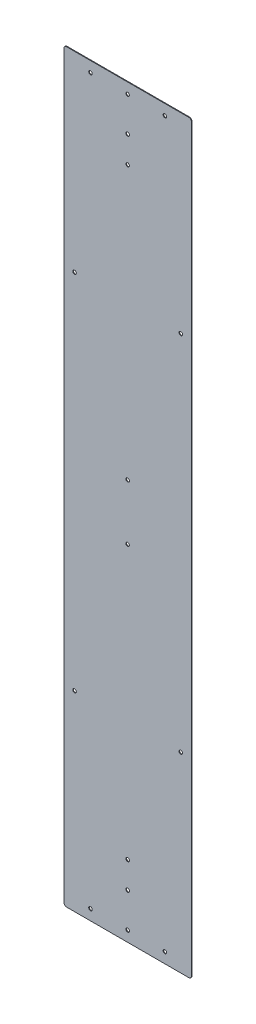
ISO-10303-21;
HEADER;
FILE_DESCRIPTION(('STEP AP214'),'2;1');
FILE_NAME('part.step','',(''),(''),'','','');
FILE_SCHEMA(('AUTOMOTIVE_DESIGN { 1 0 10303 214 1 1 1 1 }'));
ENDSEC;
DATA;
#1=APPLICATION_CONTEXT('core data for automotive mechanical design processes');
#2=APPLICATION_PROTOCOL_DEFINITION('international standard','automotive_design',2000,#1);
#3=PRODUCT_CONTEXT('',#1,'mechanical');
#4=PRODUCT('Part','Part','',(#3));
#5=PRODUCT_RELATED_PRODUCT_CATEGORY('part','',(#4));
#6=PRODUCT_DEFINITION_FORMATION('','',#4);
#7=PRODUCT_DEFINITION_CONTEXT('part definition',#1,'design');
#8=PRODUCT_DEFINITION('design','',#6,#7);
#9=PRODUCT_DEFINITION_SHAPE('','',#8);
#10=(LENGTH_UNIT() NAMED_UNIT(*) SI_UNIT(.MILLI.,.METRE.));
#11=(NAMED_UNIT(*) PLANE_ANGLE_UNIT() SI_UNIT($,.RADIAN.));
#12=(NAMED_UNIT(*) SI_UNIT($,.STERADIAN.) SOLID_ANGLE_UNIT());
#13=UNCERTAINTY_MEASURE_WITH_UNIT(LENGTH_MEASURE(1.E-05),#10,'distance_accuracy_value','');
#14=(GEOMETRIC_REPRESENTATION_CONTEXT(3) GLOBAL_UNCERTAINTY_ASSIGNED_CONTEXT((#13)) GLOBAL_UNIT_ASSIGNED_CONTEXT((#10,
#11,#12)) REPRESENTATION_CONTEXT('',''));
#15=CARTESIAN_POINT('',(0.,0.,0.));
#16=DIRECTION('',(0.,0.,1.));
#17=DIRECTION('',(1.,0.,0.));
#18=AXIS2_PLACEMENT_3D('',#15,#16,#17);
#19=CARTESIAN_POINT('',(152.4,890.5875,1.5875));
#20=DIRECTION('',(-1.,0.,0.));
#21=DIRECTION('',(0.,-1.,0.));
#22=AXIS2_PLACEMENT_3D('',#19,#20,#21);
#23=PLANE('',#22);
#24=DIRECTION('',(0.,1.,0.));
#25=VECTOR('',#24,1.);
#26=CARTESIAN_POINT('',(152.4,890.5875,0.));
#27=LINE('',#26,#25);
#28=CARTESIAN_POINT('',(152.4,-884.2375,0.));
#29=VERTEX_POINT('',#28);
#30=CARTESIAN_POINT('',(152.4,884.2375,0.));
#31=VERTEX_POINT('',#30);
#32=EDGE_CURVE('E128',#29,#31,#27,.T.);
#33=ORIENTED_EDGE('',*,*,#32,.T.);
#34=DIRECTION('',(0.,0.,-1.));
#35=VECTOR('',#34,1.);
#36=CARTESIAN_POINT('',(152.4,884.2375,1.5875));
#37=LINE('',#36,#35);
#38=CARTESIAN_POINT('',(152.4,884.2375,1.5875));
#39=VERTEX_POINT('',#38);
#40=EDGE_CURVE('E151',#31,#39,#37,.F.);
#41=ORIENTED_EDGE('',*,*,#40,.T.);
#42=DIRECTION('',(0.,1.,0.));
#43=VECTOR('',#42,1.);
#44=CARTESIAN_POINT('',(152.4,890.5875,1.5875));
#45=LINE('',#44,#43);
#46=CARTESIAN_POINT('',(152.4,-884.2375,1.5875));
#47=VERTEX_POINT('',#46);
#48=EDGE_CURVE('E126',#47,#39,#45,.T.);
#49=ORIENTED_EDGE('',*,*,#48,.F.);
#50=DIRECTION('',(0.,0.,-1.));
#51=VECTOR('',#50,1.);
#52=CARTESIAN_POINT('',(152.4,-884.2375,1.5875));
#53=LINE('',#52,#51);
#54=EDGE_CURVE('E148',#47,#29,#53,.T.);
#55=ORIENTED_EDGE('',*,*,#54,.T.);
#56=EDGE_LOOP('',(#33,#41,#49,#55));
#57=FACE_BOUND('',#56,.T.);
#58=ADVANCED_FACE('F33',(#57),#23,.F.);
#59=CARTESIAN_POINT('',(-152.4,890.5875,1.5875));
#60=DIRECTION('',(0.,-1.,0.));
#61=DIRECTION('',(0.,0.,-1.));
#62=AXIS2_PLACEMENT_3D('',#59,#60,#61);
#63=PLANE('',#62);
#64=DIRECTION('',(-1.,0.,0.));
#65=VECTOR('',#64,1.);
#66=CARTESIAN_POINT('',(-152.4,890.5875,0.));
#67=LINE('',#66,#65);
#68=CARTESIAN_POINT('',(146.05,890.5875,0.));
#69=VERTEX_POINT('',#68);
#70=CARTESIAN_POINT('',(-146.05,890.5875,0.));
#71=VERTEX_POINT('',#70);
#72=EDGE_CURVE('E124',#69,#71,#67,.T.);
#73=ORIENTED_EDGE('',*,*,#72,.T.);
#74=DIRECTION('',(0.,0.,-1.));
#75=VECTOR('',#74,1.);
#76=CARTESIAN_POINT('',(-146.05,890.5875,1.5875));
#77=LINE('',#76,#75);
#78=CARTESIAN_POINT('',(-146.05,890.5875,1.5875));
#79=VERTEX_POINT('',#78);
#80=EDGE_CURVE('E103',#71,#79,#77,.F.);
#81=ORIENTED_EDGE('',*,*,#80,.T.);
#82=DIRECTION('',(-1.,0.,0.));
#83=VECTOR('',#82,1.);
#84=CARTESIAN_POINT('',(-152.4,890.5875,1.5875));
#85=LINE('',#84,#83);
#86=CARTESIAN_POINT('',(146.05,890.5875,1.5875));
#87=VERTEX_POINT('',#86);
#88=EDGE_CURVE('E167',#87,#79,#85,.T.);
#89=ORIENTED_EDGE('',*,*,#88,.F.);
#90=DIRECTION('',(0.,0.,-1.));
#91=VECTOR('',#90,1.);
#92=CARTESIAN_POINT('',(146.05,890.5875,1.5875));
#93=LINE('',#92,#91);
#94=EDGE_CURVE('E108',#87,#69,#93,.T.);
#95=ORIENTED_EDGE('',*,*,#94,.T.);
#96=EDGE_LOOP('',(#73,#81,#89,#95));
#97=FACE_BOUND('',#96,.T.);
#98=ADVANCED_FACE('F312',(#97),#63,.F.);
#99=CARTESIAN_POINT('',(-152.4,890.5875,1.5875));
#100=DIRECTION('',(1.,0.,0.));
#101=DIRECTION('',(0.,1.,0.));
#102=AXIS2_PLACEMENT_3D('',#99,#100,#101);
#103=PLANE('',#102);
#104=DIRECTION('',(0.,-1.,0.));
#105=VECTOR('',#104,1.);
#106=CARTESIAN_POINT('',(-152.4,890.5875,1.5875));
#107=LINE('',#106,#105);
#108=CARTESIAN_POINT('',(-152.4,884.2375,1.5875));
#109=VERTEX_POINT('',#108);
#110=CARTESIAN_POINT('',(-152.4,-884.2375,1.5875));
#111=VERTEX_POINT('',#110);
#112=EDGE_CURVE('E117',#109,#111,#107,.T.);
#113=ORIENTED_EDGE('',*,*,#112,.F.);
#114=DIRECTION('',(0.,0.,-1.));
#115=VECTOR('',#114,1.);
#116=CARTESIAN_POINT('',(-152.4,884.2375,1.5875));
#117=LINE('',#116,#115);
#118=CARTESIAN_POINT('',(-152.4,884.2375,0.));
#119=VERTEX_POINT('',#118);
#120=EDGE_CURVE('E102',#109,#119,#117,.T.);
#121=ORIENTED_EDGE('',*,*,#120,.T.);
#122=DIRECTION('',(0.,-1.,0.));
#123=VECTOR('',#122,1.);
#124=CARTESIAN_POINT('',(-152.4,890.5875,0.));
#125=LINE('',#124,#123);
#126=CARTESIAN_POINT('',(-152.4,-884.2375,0.));
#127=VERTEX_POINT('',#126);
#128=EDGE_CURVE('E115',#119,#127,#125,.T.);
#129=ORIENTED_EDGE('',*,*,#128,.T.);
#130=DIRECTION('',(0.,0.,-1.));
#131=VECTOR('',#130,1.);
#132=CARTESIAN_POINT('',(-152.4,-884.2375,1.5875));
#133=LINE('',#132,#131);
#134=EDGE_CURVE('E119',#127,#111,#133,.F.);
#135=ORIENTED_EDGE('',*,*,#134,.T.);
#136=EDGE_LOOP('',(#113,#121,#129,#135));
#137=FACE_BOUND('',#136,.T.);
#138=ADVANCED_FACE('F114',(#137),#103,.F.);
#139=CARTESIAN_POINT('',(-152.4,-890.5875,1.5875));
#140=DIRECTION('',(0.,1.,0.));
#141=DIRECTION('',(0.,0.,1.));
#142=AXIS2_PLACEMENT_3D('',#139,#140,#141);
#143=PLANE('',#142);
#144=DIRECTION('',(1.,0.,0.));
#145=VECTOR('',#144,1.);
#146=CARTESIAN_POINT('',(-152.4,-890.5875,0.));
#147=LINE('',#146,#145);
#148=CARTESIAN_POINT('',(-146.05,-890.5875,0.));
#149=VERTEX_POINT('',#148);
#150=CARTESIAN_POINT('',(146.05,-890.5875,0.));
#151=VERTEX_POINT('',#150);
#152=EDGE_CURVE('E123',#149,#151,#147,.T.);
#153=ORIENTED_EDGE('',*,*,#152,.T.);
#154=DIRECTION('',(0.,0.,-1.));
#155=VECTOR('',#154,1.);
#156=CARTESIAN_POINT('',(146.05,-890.5875,1.5875));
#157=LINE('',#156,#155);
#158=CARTESIAN_POINT('',(146.05,-890.5875,1.5875));
#159=VERTEX_POINT('',#158);
#160=EDGE_CURVE('E11',#151,#159,#157,.F.);
#161=ORIENTED_EDGE('',*,*,#160,.T.);
#162=DIRECTION('',(1.,0.,0.));
#163=VECTOR('',#162,1.);
#164=CARTESIAN_POINT('',(-152.4,-890.5875,1.5875));
#165=LINE('',#164,#163);
#166=CARTESIAN_POINT('',(-146.05,-890.5875,1.5875));
#167=VERTEX_POINT('',#166);
#168=EDGE_CURVE('E132',#167,#159,#165,.T.);
#169=ORIENTED_EDGE('',*,*,#168,.F.);
#170=DIRECTION('',(0.,0.,-1.));
#171=VECTOR('',#170,1.);
#172=CARTESIAN_POINT('',(-146.05,-890.5875,1.5875));
#173=LINE('',#172,#171);
#174=EDGE_CURVE('E41',#167,#149,#173,.T.);
#175=ORIENTED_EDGE('',*,*,#174,.T.);
#176=EDGE_LOOP('',(#153,#161,#169,#175));
#177=FACE_BOUND('',#176,.T.);
#178=ADVANCED_FACE('F154',(#177),#143,.F.);
#179=CARTESIAN_POINT('',(0.,0.,1.5875));
#180=DIRECTION('',(0.,0.,1.));
#181=DIRECTION('',(1.,0.,0.));
#182=AXIS2_PLACEMENT_3D('',#179,#180,#181);
#183=PLANE('',#182);
#184=CARTESIAN_POINT('',(0.,865.1875,1.5875));
#185=DIRECTION('',(0.,0.,1.));
#186=DIRECTION('',(1.,0.,0.));
#187=AXIS2_PLACEMENT_3D('',#184,#185,#186);
#188=CIRCLE('',#187,4.2164);
#189=CARTESIAN_POINT('',(4.2164,865.1875,1.5875));
#190=VERTEX_POINT('',#189);
#191=EDGE_CURVE('E271',#190,#190,#188,.T.);
#192=ORIENTED_EDGE('',*,*,#191,.F.);
#193=EDGE_LOOP('',(#192));
#194=FACE_BOUND('',#193,.T.);
#195=CARTESIAN_POINT('',(-127.,433.3875,1.5875));
#196=DIRECTION('',(0.,0.,1.));
#197=DIRECTION('',(1.,0.,0.));
#198=AXIS2_PLACEMENT_3D('',#195,#196,#197);
#199=CIRCLE('',#198,4.21639999999999);
#200=CARTESIAN_POINT('',(-122.7836,433.3875,1.5875));
#201=VERTEX_POINT('',#200);
#202=EDGE_CURVE('E265',#201,#201,#199,.T.);
#203=ORIENTED_EDGE('',*,*,#202,.F.);
#204=EDGE_LOOP('',(#203));
#205=FACE_BOUND('',#204,.T.);
#206=CARTESIAN_POINT('',(127.,433.3875,1.5875));
#207=DIRECTION('',(0.,0.,1.));
#208=DIRECTION('',(1.,0.,0.));
#209=AXIS2_PLACEMENT_3D('',#206,#207,#208);
#210=CIRCLE('',#209,4.21640000000001);
#211=CARTESIAN_POINT('',(131.2164,433.3875,1.5875));
#212=VERTEX_POINT('',#211);
#213=EDGE_CURVE('E259',#212,#212,#210,.T.);
#214=ORIENTED_EDGE('',*,*,#213,.F.);
#215=EDGE_LOOP('',(#214));
#216=FACE_BOUND('',#215,.T.);
#217=CARTESIAN_POINT('',(0.,66.675,1.5875));
#218=DIRECTION('',(0.,0.,1.));
#219=DIRECTION('',(1.,0.,0.));
#220=AXIS2_PLACEMENT_3D('',#217,#218,#219);
#221=CIRCLE('',#220,4.2164);
#222=CARTESIAN_POINT('',(4.2164,66.675,1.5875));
#223=VERTEX_POINT('',#222);
#224=EDGE_CURVE('E253',#223,#223,#221,.T.);
#225=ORIENTED_EDGE('',*,*,#224,.F.);
#226=EDGE_LOOP('',(#225));
#227=FACE_BOUND('',#226,.T.);
#228=CARTESIAN_POINT('',(0.,-66.6749999999998,1.5875));
#229=DIRECTION('',(0.,0.,1.));
#230=DIRECTION('',(1.,0.,0.));
#231=AXIS2_PLACEMENT_3D('',#228,#229,#230);
#232=CIRCLE('',#231,4.2164);
#233=CARTESIAN_POINT('',(4.2164,-66.6749999999998,1.5875));
#234=VERTEX_POINT('',#233);
#235=EDGE_CURVE('E247',#234,#234,#232,.T.);
#236=ORIENTED_EDGE('',*,*,#235,.F.);
#237=EDGE_LOOP('',(#236));
#238=FACE_BOUND('',#237,.T.);
#239=CARTESIAN_POINT('',(-127.,-433.3875,1.5875));
#240=DIRECTION('',(0.,0.,1.));
#241=DIRECTION('',(1.,0.,0.));
#242=AXIS2_PLACEMENT_3D('',#239,#240,#241);
#243=CIRCLE('',#242,4.21639999999999);
#244=CARTESIAN_POINT('',(-122.7836,-433.3875,1.5875));
#245=VERTEX_POINT('',#244);
#246=EDGE_CURVE('E241',#245,#245,#243,.T.);
#247=ORIENTED_EDGE('',*,*,#246,.F.);
#248=EDGE_LOOP('',(#247));
#249=FACE_BOUND('',#248,.T.);
#250=CARTESIAN_POINT('',(127.,-433.3875,1.5875));
#251=DIRECTION('',(0.,0.,1.));
#252=DIRECTION('',(1.,0.,0.));
#253=AXIS2_PLACEMENT_3D('',#250,#251,#252);
#254=CIRCLE('',#253,4.21640000000001);
#255=CARTESIAN_POINT('',(131.2164,-433.3875,1.5875));
#256=VERTEX_POINT('',#255);
#257=EDGE_CURVE('E235',#256,#256,#254,.T.);
#258=ORIENTED_EDGE('',*,*,#257,.F.);
#259=EDGE_LOOP('',(#258));
#260=FACE_BOUND('',#259,.T.);
#261=CARTESIAN_POINT('',(0.,-865.1875,1.5875));
#262=DIRECTION('',(0.,0.,1.));
#263=DIRECTION('',(1.,0.,0.));
#264=AXIS2_PLACEMENT_3D('',#261,#262,#263);
#265=CIRCLE('',#264,4.2164);
#266=CARTESIAN_POINT('',(4.2164,-865.1875,1.5875));
#267=VERTEX_POINT('',#266);
#268=EDGE_CURVE('E229',#267,#267,#265,.T.);
#269=ORIENTED_EDGE('',*,*,#268,.F.);
#270=EDGE_LOOP('',(#269));
#271=FACE_BOUND('',#270,.T.);
#272=CARTESIAN_POINT('',(0.,782.6375,1.5875));
#273=DIRECTION('',(0.,0.,1.));
#274=DIRECTION('',(1.,0.,0.));
#275=AXIS2_PLACEMENT_3D('',#272,#273,#274);
#276=CIRCLE('',#275,4.2164);
#277=CARTESIAN_POINT('',(4.2164,782.6375,1.5875));
#278=VERTEX_POINT('',#277);
#279=EDGE_CURVE('E223',#278,#278,#276,.T.);
#280=ORIENTED_EDGE('',*,*,#279,.F.);
#281=EDGE_LOOP('',(#280));
#282=FACE_BOUND('',#281,.T.);
#283=CARTESIAN_POINT('',(0.,719.1375,1.5875));
#284=DIRECTION('',(0.,0.,1.));
#285=DIRECTION('',(1.,0.,0.));
#286=AXIS2_PLACEMENT_3D('',#283,#284,#285);
#287=CIRCLE('',#286,4.2164);
#288=CARTESIAN_POINT('',(4.2164,719.1375,1.5875));
#289=VERTEX_POINT('',#288);
#290=EDGE_CURVE('E217',#289,#289,#287,.T.);
#291=ORIENTED_EDGE('',*,*,#290,.F.);
#292=EDGE_LOOP('',(#291));
#293=FACE_BOUND('',#292,.T.);
#294=CARTESIAN_POINT('',(0.,-782.6375,1.5875));
#295=DIRECTION('',(0.,0.,1.));
#296=DIRECTION('',(1.,0.,0.));
#297=AXIS2_PLACEMENT_3D('',#294,#295,#296);
#298=CIRCLE('',#297,4.2164);
#299=CARTESIAN_POINT('',(4.2164,-782.6375,1.5875));
#300=VERTEX_POINT('',#299);
#301=EDGE_CURVE('E211',#300,#300,#298,.T.);
#302=ORIENTED_EDGE('',*,*,#301,.F.);
#303=EDGE_LOOP('',(#302));
#304=FACE_BOUND('',#303,.T.);
#305=CARTESIAN_POINT('',(0.,-719.1375,1.5875));
#306=DIRECTION('',(0.,0.,1.));
#307=DIRECTION('',(1.,0.,0.));
#308=AXIS2_PLACEMENT_3D('',#305,#306,#307);
#309=CIRCLE('',#308,4.2164);
#310=CARTESIAN_POINT('',(4.2164,-719.1375,1.5875));
#311=VERTEX_POINT('',#310);
#312=EDGE_CURVE('E205',#311,#311,#309,.T.);
#313=ORIENTED_EDGE('',*,*,#312,.F.);
#314=EDGE_LOOP('',(#313));
#315=FACE_BOUND('',#314,.T.);
#316=CARTESIAN_POINT('',(-88.9,865.1875,1.5875));
#317=DIRECTION('',(0.,0.,1.));
#318=DIRECTION('',(1.,0.,0.));
#319=AXIS2_PLACEMENT_3D('',#316,#317,#318);
#320=CIRCLE('',#319,4.21639999999999);
#321=CARTESIAN_POINT('',(-84.6836,865.1875,1.5875));
#322=VERTEX_POINT('',#321);
#323=EDGE_CURVE('E199',#322,#322,#320,.T.);
#324=ORIENTED_EDGE('',*,*,#323,.F.);
#325=EDGE_LOOP('',(#324));
#326=FACE_BOUND('',#325,.T.);
#327=CARTESIAN_POINT('',(88.9,865.1875,1.5875));
#328=DIRECTION('',(0.,0.,1.));
#329=DIRECTION('',(1.,0.,0.));
#330=AXIS2_PLACEMENT_3D('',#327,#328,#329);
#331=CIRCLE('',#330,4.21639999999999);
#332=CARTESIAN_POINT('',(93.1164,865.1875,1.5875));
#333=VERTEX_POINT('',#332);
#334=EDGE_CURVE('E193',#333,#333,#331,.T.);
#335=ORIENTED_EDGE('',*,*,#334,.F.);
#336=EDGE_LOOP('',(#335));
#337=FACE_BOUND('',#336,.T.);
#338=CARTESIAN_POINT('',(-88.8999999999989,-865.1875,1.5875));
#339=DIRECTION('',(0.,0.,1.));
#340=DIRECTION('',(1.,0.,0.));
#341=AXIS2_PLACEMENT_3D('',#338,#339,#340);
#342=CIRCLE('',#341,4.21639999999999);
#343=CARTESIAN_POINT('',(-84.6835999999989,-865.1875,1.5875));
#344=VERTEX_POINT('',#343);
#345=EDGE_CURVE('E185',#344,#344,#342,.T.);
#346=ORIENTED_EDGE('',*,*,#345,.F.);
#347=EDGE_LOOP('',(#346));
#348=FACE_BOUND('',#347,.T.);
#349=CARTESIAN_POINT('',(88.9,-865.1875,1.5875));
#350=DIRECTION('',(0.,0.,1.));
#351=DIRECTION('',(1.,0.,0.));
#352=AXIS2_PLACEMENT_3D('',#349,#350,#351);
#353=CIRCLE('',#352,4.21639999999999);
#354=CARTESIAN_POINT('',(93.1164,-865.1875,1.5875));
#355=VERTEX_POINT('',#354);
#356=EDGE_CURVE('E177',#355,#355,#353,.T.);
#357=ORIENTED_EDGE('',*,*,#356,.F.);
#358=EDGE_LOOP('',(#357));
#359=FACE_BOUND('',#358,.T.);
#360=ORIENTED_EDGE('',*,*,#88,.T.);
#361=CARTESIAN_POINT('',(-146.05,884.2375,1.5875));
#362=DIRECTION('',(0.,0.,1.));
#363=DIRECTION('',(1.,0.,0.));
#364=AXIS2_PLACEMENT_3D('',#361,#362,#363);
#365=CIRCLE('',#364,6.35);
#366=EDGE_CURVE('E146',#79,#109,#365,.T.);
#367=ORIENTED_EDGE('',*,*,#366,.T.);
#368=ORIENTED_EDGE('',*,*,#112,.T.);
#369=CARTESIAN_POINT('',(-146.05,-884.2375,1.5875));
#370=DIRECTION('',(0.,0.,1.));
#371=DIRECTION('',(1.,0.,0.));
#372=AXIS2_PLACEMENT_3D('',#369,#370,#371);
#373=CIRCLE('',#372,6.35);
#374=EDGE_CURVE('E53',#111,#167,#373,.T.);
#375=ORIENTED_EDGE('',*,*,#374,.T.);
#376=ORIENTED_EDGE('',*,*,#168,.T.);
#377=CARTESIAN_POINT('',(146.05,-884.2375,1.5875));
#378=DIRECTION('',(0.,0.,1.));
#379=DIRECTION('',(1.,0.,0.));
#380=AXIS2_PLACEMENT_3D('',#377,#378,#379);
#381=CIRCLE('',#380,6.35);
#382=EDGE_CURVE('E142',#159,#47,#381,.T.);
#383=ORIENTED_EDGE('',*,*,#382,.T.);
#384=ORIENTED_EDGE('',*,*,#48,.T.);
#385=CARTESIAN_POINT('',(146.05,884.2375,1.5875));
#386=DIRECTION('',(0.,0.,1.));
#387=DIRECTION('',(1.,0.,0.));
#388=AXIS2_PLACEMENT_3D('',#385,#386,#387);
#389=CIRCLE('',#388,6.35);
#390=EDGE_CURVE('E144',#39,#87,#389,.T.);
#391=ORIENTED_EDGE('',*,*,#390,.T.);
#392=EDGE_LOOP('',(#360,#367,#368,#375,#376,#383,#384,#391));
#393=FACE_BOUND('',#392,.T.);
#394=ADVANCED_FACE('F277',(#194,#205,#216,#227,#238,#249,#260,#271,#282,#293,#304,#315,#326,
#337,#348,#359,#393),#183,.T.);
#395=CARTESIAN_POINT('',(0.,0.,0.));
#396=DIRECTION('',(0.,0.,1.));
#397=DIRECTION('',(1.,0.,0.));
#398=AXIS2_PLACEMENT_3D('',#395,#396,#397);
#399=PLANE('',#398);
#400=CARTESIAN_POINT('',(0.,865.1875,0.));
#401=DIRECTION('',(0.,0.,1.));
#402=DIRECTION('',(1.,0.,0.));
#403=AXIS2_PLACEMENT_3D('',#400,#401,#402);
#404=CIRCLE('',#403,4.2164);
#405=CARTESIAN_POINT('',(4.2164,865.1875,0.));
#406=VERTEX_POINT('',#405);
#407=EDGE_CURVE('E268',#406,#406,#404,.T.);
#408=ORIENTED_EDGE('',*,*,#407,.T.);
#409=EDGE_LOOP('',(#408));
#410=FACE_BOUND('',#409,.T.);
#411=CARTESIAN_POINT('',(-127.,433.3875,0.));
#412=DIRECTION('',(0.,0.,1.));
#413=DIRECTION('',(1.,0.,0.));
#414=AXIS2_PLACEMENT_3D('',#411,#412,#413);
#415=CIRCLE('',#414,4.21639999999999);
#416=CARTESIAN_POINT('',(-122.7836,433.3875,0.));
#417=VERTEX_POINT('',#416);
#418=EDGE_CURVE('E262',#417,#417,#415,.T.);
#419=ORIENTED_EDGE('',*,*,#418,.T.);
#420=EDGE_LOOP('',(#419));
#421=FACE_BOUND('',#420,.T.);
#422=CARTESIAN_POINT('',(127.,433.3875,0.));
#423=DIRECTION('',(0.,0.,1.));
#424=DIRECTION('',(1.,0.,0.));
#425=AXIS2_PLACEMENT_3D('',#422,#423,#424);
#426=CIRCLE('',#425,4.21640000000001);
#427=CARTESIAN_POINT('',(131.2164,433.3875,0.));
#428=VERTEX_POINT('',#427);
#429=EDGE_CURVE('E256',#428,#428,#426,.T.);
#430=ORIENTED_EDGE('',*,*,#429,.T.);
#431=EDGE_LOOP('',(#430));
#432=FACE_BOUND('',#431,.T.);
#433=CARTESIAN_POINT('',(0.,66.675,0.));
#434=DIRECTION('',(0.,0.,1.));
#435=DIRECTION('',(1.,0.,0.));
#436=AXIS2_PLACEMENT_3D('',#433,#434,#435);
#437=CIRCLE('',#436,4.2164);
#438=CARTESIAN_POINT('',(4.2164,66.675,0.));
#439=VERTEX_POINT('',#438);
#440=EDGE_CURVE('E250',#439,#439,#437,.T.);
#441=ORIENTED_EDGE('',*,*,#440,.T.);
#442=EDGE_LOOP('',(#441));
#443=FACE_BOUND('',#442,.T.);
#444=CARTESIAN_POINT('',(0.,-66.6749999999998,0.));
#445=DIRECTION('',(0.,0.,1.));
#446=DIRECTION('',(1.,0.,0.));
#447=AXIS2_PLACEMENT_3D('',#444,#445,#446);
#448=CIRCLE('',#447,4.2164);
#449=CARTESIAN_POINT('',(4.2164,-66.6749999999998,0.));
#450=VERTEX_POINT('',#449);
#451=EDGE_CURVE('E244',#450,#450,#448,.T.);
#452=ORIENTED_EDGE('',*,*,#451,.T.);
#453=EDGE_LOOP('',(#452));
#454=FACE_BOUND('',#453,.T.);
#455=CARTESIAN_POINT('',(-127.,-433.3875,0.));
#456=DIRECTION('',(0.,0.,1.));
#457=DIRECTION('',(1.,0.,0.));
#458=AXIS2_PLACEMENT_3D('',#455,#456,#457);
#459=CIRCLE('',#458,4.21639999999999);
#460=CARTESIAN_POINT('',(-122.7836,-433.3875,0.));
#461=VERTEX_POINT('',#460);
#462=EDGE_CURVE('E238',#461,#461,#459,.T.);
#463=ORIENTED_EDGE('',*,*,#462,.T.);
#464=EDGE_LOOP('',(#463));
#465=FACE_BOUND('',#464,.T.);
#466=CARTESIAN_POINT('',(127.,-433.3875,0.));
#467=DIRECTION('',(0.,0.,1.));
#468=DIRECTION('',(1.,0.,0.));
#469=AXIS2_PLACEMENT_3D('',#466,#467,#468);
#470=CIRCLE('',#469,4.21640000000001);
#471=CARTESIAN_POINT('',(131.2164,-433.3875,0.));
#472=VERTEX_POINT('',#471);
#473=EDGE_CURVE('E232',#472,#472,#470,.T.);
#474=ORIENTED_EDGE('',*,*,#473,.T.);
#475=EDGE_LOOP('',(#474));
#476=FACE_BOUND('',#475,.T.);
#477=CARTESIAN_POINT('',(0.,-865.1875,0.));
#478=DIRECTION('',(0.,0.,1.));
#479=DIRECTION('',(1.,0.,0.));
#480=AXIS2_PLACEMENT_3D('',#477,#478,#479);
#481=CIRCLE('',#480,4.2164);
#482=CARTESIAN_POINT('',(4.2164,-865.1875,0.));
#483=VERTEX_POINT('',#482);
#484=EDGE_CURVE('E226',#483,#483,#481,.T.);
#485=ORIENTED_EDGE('',*,*,#484,.T.);
#486=EDGE_LOOP('',(#485));
#487=FACE_BOUND('',#486,.T.);
#488=CARTESIAN_POINT('',(0.,782.6375,0.));
#489=DIRECTION('',(0.,0.,1.));
#490=DIRECTION('',(1.,0.,0.));
#491=AXIS2_PLACEMENT_3D('',#488,#489,#490);
#492=CIRCLE('',#491,4.2164);
#493=CARTESIAN_POINT('',(4.2164,782.6375,0.));
#494=VERTEX_POINT('',#493);
#495=EDGE_CURVE('E220',#494,#494,#492,.T.);
#496=ORIENTED_EDGE('',*,*,#495,.T.);
#497=EDGE_LOOP('',(#496));
#498=FACE_BOUND('',#497,.T.);
#499=CARTESIAN_POINT('',(0.,719.1375,0.));
#500=DIRECTION('',(0.,0.,1.));
#501=DIRECTION('',(1.,0.,0.));
#502=AXIS2_PLACEMENT_3D('',#499,#500,#501);
#503=CIRCLE('',#502,4.2164);
#504=CARTESIAN_POINT('',(4.2164,719.1375,0.));
#505=VERTEX_POINT('',#504);
#506=EDGE_CURVE('E214',#505,#505,#503,.T.);
#507=ORIENTED_EDGE('',*,*,#506,.T.);
#508=EDGE_LOOP('',(#507));
#509=FACE_BOUND('',#508,.T.);
#510=CARTESIAN_POINT('',(0.,-782.6375,0.));
#511=DIRECTION('',(0.,0.,1.));
#512=DIRECTION('',(1.,0.,0.));
#513=AXIS2_PLACEMENT_3D('',#510,#511,#512);
#514=CIRCLE('',#513,4.2164);
#515=CARTESIAN_POINT('',(4.2164,-782.6375,0.));
#516=VERTEX_POINT('',#515);
#517=EDGE_CURVE('E208',#516,#516,#514,.T.);
#518=ORIENTED_EDGE('',*,*,#517,.T.);
#519=EDGE_LOOP('',(#518));
#520=FACE_BOUND('',#519,.T.);
#521=CARTESIAN_POINT('',(0.,-719.1375,0.));
#522=DIRECTION('',(0.,0.,1.));
#523=DIRECTION('',(1.,0.,0.));
#524=AXIS2_PLACEMENT_3D('',#521,#522,#523);
#525=CIRCLE('',#524,4.2164);
#526=CARTESIAN_POINT('',(4.2164,-719.1375,0.));
#527=VERTEX_POINT('',#526);
#528=EDGE_CURVE('E202',#527,#527,#525,.T.);
#529=ORIENTED_EDGE('',*,*,#528,.T.);
#530=EDGE_LOOP('',(#529));
#531=FACE_BOUND('',#530,.T.);
#532=CARTESIAN_POINT('',(-88.9,865.1875,0.));
#533=DIRECTION('',(0.,0.,1.));
#534=DIRECTION('',(1.,0.,0.));
#535=AXIS2_PLACEMENT_3D('',#532,#533,#534);
#536=CIRCLE('',#535,4.21639999999999);
#537=CARTESIAN_POINT('',(-84.6836,865.1875,0.));
#538=VERTEX_POINT('',#537);
#539=EDGE_CURVE('E196',#538,#538,#536,.T.);
#540=ORIENTED_EDGE('',*,*,#539,.T.);
#541=EDGE_LOOP('',(#540));
#542=FACE_BOUND('',#541,.T.);
#543=CARTESIAN_POINT('',(88.9,865.1875,0.));
#544=DIRECTION('',(0.,0.,1.));
#545=DIRECTION('',(1.,0.,0.));
#546=AXIS2_PLACEMENT_3D('',#543,#544,#545);
#547=CIRCLE('',#546,4.21639999999999);
#548=CARTESIAN_POINT('',(93.1164,865.1875,0.));
#549=VERTEX_POINT('',#548);
#550=EDGE_CURVE('E190',#549,#549,#547,.T.);
#551=ORIENTED_EDGE('',*,*,#550,.T.);
#552=EDGE_LOOP('',(#551));
#553=FACE_BOUND('',#552,.T.);
#554=CARTESIAN_POINT('',(-88.8999999999989,-865.1875,0.));
#555=DIRECTION('',(0.,0.,1.));
#556=DIRECTION('',(1.,0.,0.));
#557=AXIS2_PLACEMENT_3D('',#554,#555,#556);
#558=CIRCLE('',#557,4.21639999999999);
#559=CARTESIAN_POINT('',(-84.6835999999989,-865.1875,0.));
#560=VERTEX_POINT('',#559);
#561=EDGE_CURVE('E181',#560,#560,#558,.T.);
#562=ORIENTED_EDGE('',*,*,#561,.T.);
#563=EDGE_LOOP('',(#562));
#564=FACE_BOUND('',#563,.T.);
#565=CARTESIAN_POINT('',(88.9,-865.1875,0.));
#566=DIRECTION('',(0.,0.,1.));
#567=DIRECTION('',(1.,0.,0.));
#568=AXIS2_PLACEMENT_3D('',#565,#566,#567);
#569=CIRCLE('',#568,4.21639999999999);
#570=CARTESIAN_POINT('',(93.1164,-865.1875,0.));
#571=VERTEX_POINT('',#570);
#572=EDGE_CURVE('E172',#571,#571,#569,.T.);
#573=ORIENTED_EDGE('',*,*,#572,.T.);
#574=EDGE_LOOP('',(#573));
#575=FACE_BOUND('',#574,.T.);
#576=ORIENTED_EDGE('',*,*,#128,.F.);
#577=CARTESIAN_POINT('',(-146.05,884.2375,0.));
#578=DIRECTION('',(0.,0.,1.));
#579=DIRECTION('',(1.,0.,0.));
#580=AXIS2_PLACEMENT_3D('',#577,#578,#579);
#581=CIRCLE('',#580,6.35);
#582=EDGE_CURVE('E98',#119,#71,#581,.F.);
#583=ORIENTED_EDGE('',*,*,#582,.T.);
#584=ORIENTED_EDGE('',*,*,#72,.F.);
#585=CARTESIAN_POINT('',(146.05,884.2375,0.));
#586=DIRECTION('',(0.,0.,1.));
#587=DIRECTION('',(1.,0.,0.));
#588=AXIS2_PLACEMENT_3D('',#585,#586,#587);
#589=CIRCLE('',#588,6.35);
#590=EDGE_CURVE('E109',#69,#31,#589,.F.);
#591=ORIENTED_EDGE('',*,*,#590,.T.);
#592=ORIENTED_EDGE('',*,*,#32,.F.);
#593=CARTESIAN_POINT('',(146.05,-884.2375,0.));
#594=DIRECTION('',(0.,0.,1.));
#595=DIRECTION('',(1.,0.,0.));
#596=AXIS2_PLACEMENT_3D('',#593,#594,#595);
#597=CIRCLE('',#596,6.35);
#598=EDGE_CURVE('E135',#29,#151,#597,.F.);
#599=ORIENTED_EDGE('',*,*,#598,.T.);
#600=ORIENTED_EDGE('',*,*,#152,.F.);
#601=CARTESIAN_POINT('',(-146.05,-884.2375,0.));
#602=DIRECTION('',(0.,0.,1.));
#603=DIRECTION('',(1.,0.,0.));
#604=AXIS2_PLACEMENT_3D('',#601,#602,#603);
#605=CIRCLE('',#604,6.35);
#606=EDGE_CURVE('E118',#149,#127,#605,.F.);
#607=ORIENTED_EDGE('',*,*,#606,.T.);
#608=EDGE_LOOP('',(#576,#583,#584,#591,#592,#599,#600,#607));
#609=FACE_BOUND('',#608,.T.);
#610=ADVANCED_FACE('F121',(#410,#421,#432,#443,#454,#465,#476,#487,#498,#509,#520,#531,#542,
#553,#564,#575,#609),#399,.F.);
#611=CARTESIAN_POINT('',(88.9,-865.1875,1.5875));
#612=DIRECTION('',(0.,0.,1.));
#613=DIRECTION('',(1.,0.,0.));
#614=AXIS2_PLACEMENT_3D('',#611,#612,#613);
#615=CYLINDRICAL_SURFACE('',#614,4.21639999999999);
#616=ORIENTED_EDGE('',*,*,#572,.F.);
#617=EDGE_LOOP('',(#616));
#618=FACE_BOUND('',#617,.T.);
#619=ORIENTED_EDGE('',*,*,#356,.T.);
#620=EDGE_LOOP('',(#619));
#621=FACE_BOUND('',#620,.T.);
#622=ADVANCED_FACE('F334',(#618,#621),#615,.F.);
#623=CARTESIAN_POINT('',(-88.8999999999989,-865.1875,1.5875));
#624=DIRECTION('',(0.,0.,1.));
#625=DIRECTION('',(1.,0.,0.));
#626=AXIS2_PLACEMENT_3D('',#623,#624,#625);
#627=CYLINDRICAL_SURFACE('',#626,4.21639999999999);
#628=ORIENTED_EDGE('',*,*,#561,.F.);
#629=EDGE_LOOP('',(#628));
#630=FACE_BOUND('',#629,.T.);
#631=ORIENTED_EDGE('',*,*,#345,.T.);
#632=EDGE_LOOP('',(#631));
#633=FACE_BOUND('',#632,.T.);
#634=ADVANCED_FACE('F339',(#630,#633),#627,.F.);
#635=CARTESIAN_POINT('',(88.9,865.1875,1.5875));
#636=DIRECTION('',(0.,0.,1.));
#637=DIRECTION('',(1.,0.,0.));
#638=AXIS2_PLACEMENT_3D('',#635,#636,#637);
#639=CYLINDRICAL_SURFACE('',#638,4.21639999999999);
#640=ORIENTED_EDGE('',*,*,#550,.F.);
#641=EDGE_LOOP('',(#640));
#642=FACE_BOUND('',#641,.T.);
#643=ORIENTED_EDGE('',*,*,#334,.T.);
#644=EDGE_LOOP('',(#643));
#645=FACE_BOUND('',#644,.T.);
#646=ADVANCED_FACE('F343',(#642,#645),#639,.F.);
#647=CARTESIAN_POINT('',(-88.9,865.1875,1.5875));
#648=DIRECTION('',(0.,0.,1.));
#649=DIRECTION('',(1.,0.,0.));
#650=AXIS2_PLACEMENT_3D('',#647,#648,#649);
#651=CYLINDRICAL_SURFACE('',#650,4.21639999999999);
#652=ORIENTED_EDGE('',*,*,#539,.F.);
#653=EDGE_LOOP('',(#652));
#654=FACE_BOUND('',#653,.T.);
#655=ORIENTED_EDGE('',*,*,#323,.T.);
#656=EDGE_LOOP('',(#655));
#657=FACE_BOUND('',#656,.T.);
#658=ADVANCED_FACE('F347',(#654,#657),#651,.F.);
#659=CARTESIAN_POINT('',(0.,-719.1375,1.5875));
#660=DIRECTION('',(0.,0.,1.));
#661=DIRECTION('',(1.,0.,0.));
#662=AXIS2_PLACEMENT_3D('',#659,#660,#661);
#663=CYLINDRICAL_SURFACE('',#662,4.2164);
#664=ORIENTED_EDGE('',*,*,#528,.F.);
#665=EDGE_LOOP('',(#664));
#666=FACE_BOUND('',#665,.T.);
#667=ORIENTED_EDGE('',*,*,#312,.T.);
#668=EDGE_LOOP('',(#667));
#669=FACE_BOUND('',#668,.T.);
#670=ADVANCED_FACE('F351',(#666,#669),#663,.F.);
#671=CARTESIAN_POINT('',(0.,-782.6375,1.5875));
#672=DIRECTION('',(0.,0.,1.));
#673=DIRECTION('',(1.,0.,0.));
#674=AXIS2_PLACEMENT_3D('',#671,#672,#673);
#675=CYLINDRICAL_SURFACE('',#674,4.2164);
#676=ORIENTED_EDGE('',*,*,#517,.F.);
#677=EDGE_LOOP('',(#676));
#678=FACE_BOUND('',#677,.T.);
#679=ORIENTED_EDGE('',*,*,#301,.T.);
#680=EDGE_LOOP('',(#679));
#681=FACE_BOUND('',#680,.T.);
#682=ADVANCED_FACE('F355',(#678,#681),#675,.F.);
#683=CARTESIAN_POINT('',(0.,719.1375,1.5875));
#684=DIRECTION('',(0.,0.,1.));
#685=DIRECTION('',(1.,0.,0.));
#686=AXIS2_PLACEMENT_3D('',#683,#684,#685);
#687=CYLINDRICAL_SURFACE('',#686,4.2164);
#688=ORIENTED_EDGE('',*,*,#506,.F.);
#689=EDGE_LOOP('',(#688));
#690=FACE_BOUND('',#689,.T.);
#691=ORIENTED_EDGE('',*,*,#290,.T.);
#692=EDGE_LOOP('',(#691));
#693=FACE_BOUND('',#692,.T.);
#694=ADVANCED_FACE('F359',(#690,#693),#687,.F.);
#695=CARTESIAN_POINT('',(0.,782.6375,1.5875));
#696=DIRECTION('',(0.,0.,1.));
#697=DIRECTION('',(1.,0.,0.));
#698=AXIS2_PLACEMENT_3D('',#695,#696,#697);
#699=CYLINDRICAL_SURFACE('',#698,4.2164);
#700=ORIENTED_EDGE('',*,*,#495,.F.);
#701=EDGE_LOOP('',(#700));
#702=FACE_BOUND('',#701,.T.);
#703=ORIENTED_EDGE('',*,*,#279,.T.);
#704=EDGE_LOOP('',(#703));
#705=FACE_BOUND('',#704,.T.);
#706=ADVANCED_FACE('F363',(#702,#705),#699,.F.);
#707=CARTESIAN_POINT('',(0.,-865.1875,1.5875));
#708=DIRECTION('',(0.,0.,1.));
#709=DIRECTION('',(1.,0.,0.));
#710=AXIS2_PLACEMENT_3D('',#707,#708,#709);
#711=CYLINDRICAL_SURFACE('',#710,4.2164);
#712=ORIENTED_EDGE('',*,*,#484,.F.);
#713=EDGE_LOOP('',(#712));
#714=FACE_BOUND('',#713,.T.);
#715=ORIENTED_EDGE('',*,*,#268,.T.);
#716=EDGE_LOOP('',(#715));
#717=FACE_BOUND('',#716,.T.);
#718=ADVANCED_FACE('F367',(#714,#717),#711,.F.);
#719=CARTESIAN_POINT('',(127.,-433.3875,1.5875));
#720=DIRECTION('',(0.,0.,1.));
#721=DIRECTION('',(1.,0.,0.));
#722=AXIS2_PLACEMENT_3D('',#719,#720,#721);
#723=CYLINDRICAL_SURFACE('',#722,4.21640000000001);
#724=ORIENTED_EDGE('',*,*,#473,.F.);
#725=EDGE_LOOP('',(#724));
#726=FACE_BOUND('',#725,.T.);
#727=ORIENTED_EDGE('',*,*,#257,.T.);
#728=EDGE_LOOP('',(#727));
#729=FACE_BOUND('',#728,.T.);
#730=ADVANCED_FACE('F371',(#726,#729),#723,.F.);
#731=CARTESIAN_POINT('',(-127.,-433.3875,1.5875));
#732=DIRECTION('',(0.,0.,1.));
#733=DIRECTION('',(1.,0.,0.));
#734=AXIS2_PLACEMENT_3D('',#731,#732,#733);
#735=CYLINDRICAL_SURFACE('',#734,4.21639999999999);
#736=ORIENTED_EDGE('',*,*,#462,.F.);
#737=EDGE_LOOP('',(#736));
#738=FACE_BOUND('',#737,.T.);
#739=ORIENTED_EDGE('',*,*,#246,.T.);
#740=EDGE_LOOP('',(#739));
#741=FACE_BOUND('',#740,.T.);
#742=ADVANCED_FACE('F375',(#738,#741),#735,.F.);
#743=CARTESIAN_POINT('',(0.,-66.6749999999998,1.5875));
#744=DIRECTION('',(0.,0.,1.));
#745=DIRECTION('',(1.,0.,0.));
#746=AXIS2_PLACEMENT_3D('',#743,#744,#745);
#747=CYLINDRICAL_SURFACE('',#746,4.2164);
#748=ORIENTED_EDGE('',*,*,#451,.F.);
#749=EDGE_LOOP('',(#748));
#750=FACE_BOUND('',#749,.T.);
#751=ORIENTED_EDGE('',*,*,#235,.T.);
#752=EDGE_LOOP('',(#751));
#753=FACE_BOUND('',#752,.T.);
#754=ADVANCED_FACE('F379',(#750,#753),#747,.F.);
#755=CARTESIAN_POINT('',(0.,66.675,1.5875));
#756=DIRECTION('',(0.,0.,1.));
#757=DIRECTION('',(1.,0.,0.));
#758=AXIS2_PLACEMENT_3D('',#755,#756,#757);
#759=CYLINDRICAL_SURFACE('',#758,4.2164);
#760=ORIENTED_EDGE('',*,*,#440,.F.);
#761=EDGE_LOOP('',(#760));
#762=FACE_BOUND('',#761,.T.);
#763=ORIENTED_EDGE('',*,*,#224,.T.);
#764=EDGE_LOOP('',(#763));
#765=FACE_BOUND('',#764,.T.);
#766=ADVANCED_FACE('F383',(#762,#765),#759,.F.);
#767=CARTESIAN_POINT('',(127.,433.3875,1.5875));
#768=DIRECTION('',(0.,0.,1.));
#769=DIRECTION('',(1.,0.,0.));
#770=AXIS2_PLACEMENT_3D('',#767,#768,#769);
#771=CYLINDRICAL_SURFACE('',#770,4.21640000000001);
#772=ORIENTED_EDGE('',*,*,#429,.F.);
#773=EDGE_LOOP('',(#772));
#774=FACE_BOUND('',#773,.T.);
#775=ORIENTED_EDGE('',*,*,#213,.T.);
#776=EDGE_LOOP('',(#775));
#777=FACE_BOUND('',#776,.T.);
#778=ADVANCED_FACE('F387',(#774,#777),#771,.F.);
#779=CARTESIAN_POINT('',(-127.,433.3875,1.5875));
#780=DIRECTION('',(0.,0.,1.));
#781=DIRECTION('',(1.,0.,0.));
#782=AXIS2_PLACEMENT_3D('',#779,#780,#781);
#783=CYLINDRICAL_SURFACE('',#782,4.21639999999999);
#784=ORIENTED_EDGE('',*,*,#418,.F.);
#785=EDGE_LOOP('',(#784));
#786=FACE_BOUND('',#785,.T.);
#787=ORIENTED_EDGE('',*,*,#202,.T.);
#788=EDGE_LOOP('',(#787));
#789=FACE_BOUND('',#788,.T.);
#790=ADVANCED_FACE('F391',(#786,#789),#783,.F.);
#791=CARTESIAN_POINT('',(0.,865.1875,1.5875));
#792=DIRECTION('',(0.,0.,1.));
#793=DIRECTION('',(1.,0.,0.));
#794=AXIS2_PLACEMENT_3D('',#791,#792,#793);
#795=CYLINDRICAL_SURFACE('',#794,4.2164);
#796=ORIENTED_EDGE('',*,*,#407,.F.);
#797=EDGE_LOOP('',(#796));
#798=FACE_BOUND('',#797,.T.);
#799=ORIENTED_EDGE('',*,*,#191,.T.);
#800=EDGE_LOOP('',(#799));
#801=FACE_BOUND('',#800,.T.);
#802=ADVANCED_FACE('F275',(#798,#801),#795,.F.);
#803=CARTESIAN_POINT('',(-146.05,884.2375,1.5875));
#804=DIRECTION('',(0.,0.,-1.));
#805=DIRECTION('',(-1.,0.,0.));
#806=AXIS2_PLACEMENT_3D('',#803,#804,#805);
#807=CYLINDRICAL_SURFACE('',#806,6.35);
#808=ORIENTED_EDGE('',*,*,#366,.F.);
#809=ORIENTED_EDGE('',*,*,#80,.F.);
#810=ORIENTED_EDGE('',*,*,#582,.F.);
#811=ORIENTED_EDGE('',*,*,#120,.F.);
#812=EDGE_LOOP('',(#808,#809,#810,#811));
#813=FACE_BOUND('',#812,.T.);
#814=ADVANCED_FACE('F101',(#813),#807,.T.);
#815=CARTESIAN_POINT('',(146.05,884.2375,1.5875));
#816=DIRECTION('',(0.,0.,-1.));
#817=DIRECTION('',(-1.,0.,0.));
#818=AXIS2_PLACEMENT_3D('',#815,#816,#817);
#819=CYLINDRICAL_SURFACE('',#818,6.35);
#820=ORIENTED_EDGE('',*,*,#390,.F.);
#821=ORIENTED_EDGE('',*,*,#40,.F.);
#822=ORIENTED_EDGE('',*,*,#590,.F.);
#823=ORIENTED_EDGE('',*,*,#94,.F.);
#824=EDGE_LOOP('',(#820,#821,#822,#823));
#825=FACE_BOUND('',#824,.T.);
#826=ADVANCED_FACE('F314',(#825),#819,.T.);
#827=CARTESIAN_POINT('',(146.05,-884.2375,1.5875));
#828=DIRECTION('',(0.,0.,-1.));
#829=DIRECTION('',(-1.,0.,0.));
#830=AXIS2_PLACEMENT_3D('',#827,#828,#829);
#831=CYLINDRICAL_SURFACE('',#830,6.35);
#832=ORIENTED_EDGE('',*,*,#382,.F.);
#833=ORIENTED_EDGE('',*,*,#160,.F.);
#834=ORIENTED_EDGE('',*,*,#598,.F.);
#835=ORIENTED_EDGE('',*,*,#54,.F.);
#836=EDGE_LOOP('',(#832,#833,#834,#835));
#837=FACE_BOUND('',#836,.T.);
#838=ADVANCED_FACE('F161',(#837),#831,.T.);
#839=CARTESIAN_POINT('',(-146.05,-884.2375,1.5875));
#840=DIRECTION('',(0.,0.,-1.));
#841=DIRECTION('',(-1.,0.,0.));
#842=AXIS2_PLACEMENT_3D('',#839,#840,#841);
#843=CYLINDRICAL_SURFACE('',#842,6.35);
#844=ORIENTED_EDGE('',*,*,#374,.F.);
#845=ORIENTED_EDGE('',*,*,#134,.F.);
#846=ORIENTED_EDGE('',*,*,#606,.F.);
#847=ORIENTED_EDGE('',*,*,#174,.F.);
#848=EDGE_LOOP('',(#844,#845,#846,#847));
#849=FACE_BOUND('',#848,.T.);
#850=ADVANCED_FACE('F35',(#849),#843,.T.);
#851=CLOSED_SHELL('',(#58,#98,#138,#178,#394,#610,#622,#634,#646,#658,#670,#682,#694,#706,#718,
#730,#742,#754,#766,#778,#790,#802,#814,#826,#838,#850));
#852=MANIFOLD_SOLID_BREP('B2',#851);
#853=ADVANCED_BREP_SHAPE_REPRESENTATION('',(#18,#852),#14);
#854=SHAPE_DEFINITION_REPRESENTATION(#9,#853);
ENDSEC;
END-ISO-10303-21;
